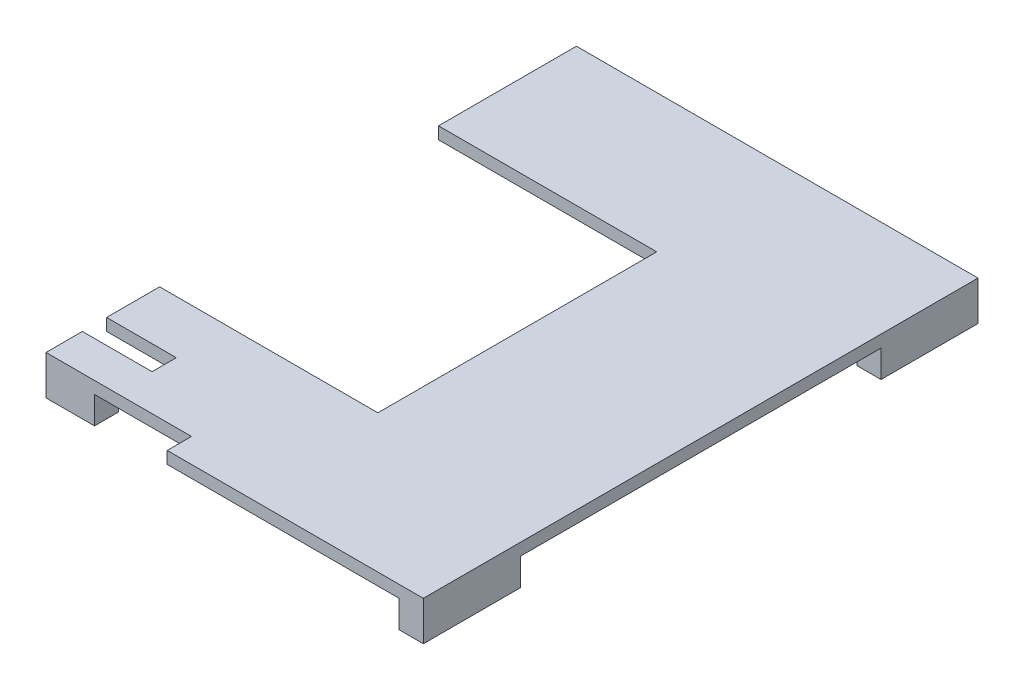
ISO-10303-21;
HEADER;
FILE_DESCRIPTION(('STEP AP214'),'2;1');
FILE_NAME('part.step','',(''),(''),'','','');
FILE_SCHEMA(('AUTOMOTIVE_DESIGN { 1 0 10303 214 1 1 1 1 }'));
ENDSEC;
DATA;
#1=APPLICATION_CONTEXT('core data for automotive mechanical design processes');
#2=APPLICATION_PROTOCOL_DEFINITION('international standard','automotive_design',2000,#1);
#3=PRODUCT_CONTEXT('',#1,'mechanical');
#4=PRODUCT('Part','Part','',(#3));
#5=PRODUCT_RELATED_PRODUCT_CATEGORY('part','',(#4));
#6=PRODUCT_DEFINITION_FORMATION('','',#4);
#7=PRODUCT_DEFINITION_CONTEXT('part definition',#1,'design');
#8=PRODUCT_DEFINITION('design','',#6,#7);
#9=PRODUCT_DEFINITION_SHAPE('','',#8);
#10=(LENGTH_UNIT() NAMED_UNIT(*) SI_UNIT(.MILLI.,.METRE.));
#11=(NAMED_UNIT(*) PLANE_ANGLE_UNIT() SI_UNIT($,.RADIAN.));
#12=(NAMED_UNIT(*) SI_UNIT($,.STERADIAN.) SOLID_ANGLE_UNIT());
#13=UNCERTAINTY_MEASURE_WITH_UNIT(LENGTH_MEASURE(1.E-05),#10,'distance_accuracy_value','');
#14=(GEOMETRIC_REPRESENTATION_CONTEXT(3) GLOBAL_UNCERTAINTY_ASSIGNED_CONTEXT((#13)) GLOBAL_UNIT_ASSIGNED_CONTEXT((#10,
#11,#12)) REPRESENTATION_CONTEXT('',''));
#15=CARTESIAN_POINT('',(0.,0.,0.));
#16=DIRECTION('',(0.,0.,1.));
#17=DIRECTION('',(1.,0.,0.));
#18=AXIS2_PLACEMENT_3D('',#15,#16,#17);
#19=CARTESIAN_POINT('',(0.,0.,0.));
#20=DIRECTION('',(1.,0.,0.));
#21=DIRECTION('',(0.,0.,-1.));
#22=AXIS2_PLACEMENT_3D('',#19,#20,#21);
#23=PLANE('',#22);
#24=DIRECTION('',(0.,0.,1.));
#25=VECTOR('',#24,1.);
#26=CARTESIAN_POINT('',(0.,6.35,0.));
#27=LINE('',#26,#25);
#28=CARTESIAN_POINT('',(0.,6.35,73.025));
#29=VERTEX_POINT('',#28);
#30=CARTESIAN_POINT('',(0.,6.35,100.80625));
#31=VERTEX_POINT('',#30);
#32=EDGE_CURVE('E379',#29,#31,#27,.T.);
#33=ORIENTED_EDGE('',*,*,#32,.F.);
#34=DIRECTION('',(0.,1.,0.));
#35=VECTOR('',#34,1.);
#36=CARTESIAN_POINT('',(0.,0.,73.025));
#37=LINE('',#36,#35);
#38=CARTESIAN_POINT('',(0.,0.,73.025));
#39=VERTEX_POINT('',#38);
#40=EDGE_CURVE('E391',#39,#29,#37,.T.);
#41=ORIENTED_EDGE('',*,*,#40,.F.);
#42=DIRECTION('',(0.,0.,1.));
#43=VECTOR('',#42,1.);
#44=CARTESIAN_POINT('',(0.,0.,0.));
#45=LINE('',#44,#43);
#46=CARTESIAN_POINT('',(0.,0.,100.80625));
#47=VERTEX_POINT('',#46);
#48=EDGE_CURVE('E382',#39,#47,#45,.T.);
#49=ORIENTED_EDGE('',*,*,#48,.T.);
#50=DIRECTION('',(0.,-1.,0.));
#51=VECTOR('',#50,1.);
#52=CARTESIAN_POINT('',(0.,0.,100.80625));
#53=LINE('',#52,#51);
#54=EDGE_CURVE('E36',#31,#47,#53,.T.);
#55=ORIENTED_EDGE('',*,*,#54,.F.);
#56=EDGE_LOOP('',(#33,#41,#49,#55));
#57=FACE_BOUND('',#56,.T.);
#58=ADVANCED_FACE('F33',(#57),#23,.F.);
#59=DIRECTION('',(0.,1.,0.));
#60=VECTOR('',#59,1.);
#61=CARTESIAN_POINT('',(0.,6.35,-145.25625));
#62=LINE('',#61,#60);
#63=CARTESIAN_POINT('',(0.,-14.2875,-145.25625));
#64=VERTEX_POINT('',#63);
#65=CARTESIAN_POINT('',(0.,6.35,-145.25625));
#66=VERTEX_POINT('',#65);
#67=EDGE_CURVE('E378',#64,#66,#62,.T.);
#68=ORIENTED_EDGE('',*,*,#67,.F.);
#69=DIRECTION('',(0.,0.,-1.));
#70=VECTOR('',#69,1.);
#71=CARTESIAN_POINT('',(0.,-14.2875,0.));
#72=LINE('',#71,#70);
#73=CARTESIAN_POINT('',(0.,-14.2875,-132.55625));
#74=VERTEX_POINT('',#73);
#75=EDGE_CURVE('E372',#74,#64,#72,.T.);
#76=ORIENTED_EDGE('',*,*,#75,.F.);
#77=DIRECTION('',(0.,-1.,0.));
#78=VECTOR('',#77,1.);
#79=CARTESIAN_POINT('',(0.,-14.2875,-132.55625));
#80=LINE('',#79,#78);
#81=CARTESIAN_POINT('',(0.,0.,-132.55625));
#82=VERTEX_POINT('',#81);
#83=EDGE_CURVE('E386',#82,#74,#80,.T.);
#84=ORIENTED_EDGE('',*,*,#83,.F.);
#85=CARTESIAN_POINT('',(0.,0.,-73.025));
#86=VERTEX_POINT('',#85);
#87=EDGE_CURVE('E383',#82,#86,#45,.T.);
#88=ORIENTED_EDGE('',*,*,#87,.T.);
#89=DIRECTION('',(0.,-1.,0.));
#90=VECTOR('',#89,1.);
#91=CARTESIAN_POINT('',(0.,0.,-73.025));
#92=LINE('',#91,#90);
#93=CARTESIAN_POINT('',(0.,6.35,-73.025));
#94=VERTEX_POINT('',#93);
#95=EDGE_CURVE('E388',#94,#86,#92,.T.);
#96=ORIENTED_EDGE('',*,*,#95,.F.);
#97=EDGE_CURVE('E376',#66,#94,#27,.T.);
#98=ORIENTED_EDGE('',*,*,#97,.F.);
#99=EDGE_LOOP('',(#68,#76,#84,#88,#96,#98));
#100=FACE_BOUND('',#99,.T.);
#101=ADVANCED_FACE('F450',(#100),#23,.F.);
#102=CARTESIAN_POINT('',(0.,0.,113.50625));
#103=VERTEX_POINT('',#102);
#104=CARTESIAN_POINT('',(0.,0.,119.85625));
#105=VERTEX_POINT('',#104);
#106=EDGE_CURVE('E41',#103,#105,#45,.T.);
#107=ORIENTED_EDGE('',*,*,#106,.T.);
#108=DIRECTION('',(0.,1.,0.));
#109=VECTOR('',#108,1.);
#110=CARTESIAN_POINT('',(0.,-14.2875,119.85625));
#111=LINE('',#110,#109);
#112=CARTESIAN_POINT('',(0.,-14.2875,119.85625));
#113=VERTEX_POINT('',#112);
#114=EDGE_CURVE('E369',#113,#105,#111,.T.);
#115=ORIENTED_EDGE('',*,*,#114,.F.);
#116=DIRECTION('',(0.,0.,1.));
#117=VECTOR('',#116,1.);
#118=CARTESIAN_POINT('',(0.,-14.2875,0.));
#119=LINE('',#118,#117);
#120=CARTESIAN_POINT('',(0.,-14.2875,132.55625));
#121=VERTEX_POINT('',#120);
#122=EDGE_CURVE('E11',#113,#121,#119,.T.);
#123=ORIENTED_EDGE('',*,*,#122,.T.);
#124=DIRECTION('',(0.,-1.,0.));
#125=VECTOR('',#124,1.);
#126=CARTESIAN_POINT('',(0.,0.,132.55625));
#127=LINE('',#126,#125);
#128=CARTESIAN_POINT('',(0.,6.35,132.55625));
#129=VERTEX_POINT('',#128);
#130=EDGE_CURVE('E55',#129,#121,#127,.T.);
#131=ORIENTED_EDGE('',*,*,#130,.F.);
#132=CARTESIAN_POINT('',(0.,6.35,113.50625));
#133=VERTEX_POINT('',#132);
#134=EDGE_CURVE('E374',#133,#129,#27,.T.);
#135=ORIENTED_EDGE('',*,*,#134,.F.);
#136=DIRECTION('',(0.,1.,0.));
#137=VECTOR('',#136,1.);
#138=CARTESIAN_POINT('',(0.,0.,113.50625));
#139=LINE('',#138,#137);
#140=EDGE_CURVE('E375',#103,#133,#139,.T.);
#141=ORIENTED_EDGE('',*,*,#140,.F.);
#142=EDGE_LOOP('',(#107,#115,#123,#131,#135,#141));
#143=FACE_BOUND('',#142,.T.);
#144=ADVANCED_FACE('F421',(#143),#23,.F.);
#145=CARTESIAN_POINT('',(0.,0.,0.));
#146=DIRECTION('',(0.,-1.,0.));
#147=DIRECTION('',(0.,0.,-1.));
#148=AXIS2_PLACEMENT_3D('',#145,#146,#147);
#149=PLANE('',#148);
#150=ORIENTED_EDGE('',*,*,#87,.F.);
#151=DIRECTION('',(-1.,0.,0.));
#152=VECTOR('',#151,1.);
#153=CARTESIAN_POINT('',(25.4,0.,-132.55625));
#154=LINE('',#153,#152);
#155=CARTESIAN_POINT('',(25.4,0.,-132.55625));
#156=VERTEX_POINT('',#155);
#157=EDGE_CURVE('E237',#156,#82,#154,.T.);
#158=ORIENTED_EDGE('',*,*,#157,.F.);
#159=DIRECTION('',(0.,0.,1.));
#160=VECTOR('',#159,1.);
#161=CARTESIAN_POINT('',(25.4,0.,-132.55625));
#162=LINE('',#161,#160);
#163=CARTESIAN_POINT('',(25.4,0.,-145.25625));
#164=VERTEX_POINT('',#163);
#165=EDGE_CURVE('E222',#164,#156,#162,.T.);
#166=ORIENTED_EDGE('',*,*,#165,.F.);
#167=DIRECTION('',(-1.,0.,0.));
#168=VECTOR('',#167,1.);
#169=CARTESIAN_POINT('',(-210.34375,0.,-145.25625));
#170=LINE('',#169,#168);
#171=CARTESIAN_POINT('',(197.64375,0.,-145.25625));
#172=VERTEX_POINT('',#171);
#173=EDGE_CURVE('E362',#172,#164,#170,.T.);
#174=ORIENTED_EDGE('',*,*,#173,.F.);
#175=DIRECTION('',(0.,0.,-1.));
#176=VECTOR('',#175,1.);
#177=CARTESIAN_POINT('',(197.64375,0.,-94.45625));
#178=LINE('',#177,#176);
#179=CARTESIAN_POINT('',(197.64375,0.,-94.45625));
#180=VERTEX_POINT('',#179);
#181=EDGE_CURVE('E255',#180,#172,#178,.T.);
#182=ORIENTED_EDGE('',*,*,#181,.F.);
#183=DIRECTION('',(-1.,0.,0.));
#184=VECTOR('',#183,1.);
#185=CARTESIAN_POINT('',(197.64375,0.,-94.45625));
#186=LINE('',#185,#184);
#187=CARTESIAN_POINT('',(210.34375,0.,-94.45625));
#188=VERTEX_POINT('',#187);
#189=EDGE_CURVE('E250',#188,#180,#186,.T.);
#190=ORIENTED_EDGE('',*,*,#189,.F.);
#191=DIRECTION('',(0.,0.,-1.));
#192=VECTOR('',#191,1.);
#193=CARTESIAN_POINT('',(210.34375,0.,145.25625));
#194=LINE('',#193,#192);
#195=CARTESIAN_POINT('',(210.34375,0.,94.4562500000002));
#196=VERTEX_POINT('',#195);
#197=EDGE_CURVE('E314',#196,#188,#194,.T.);
#198=ORIENTED_EDGE('',*,*,#197,.F.);
#199=DIRECTION('',(1.,0.,0.));
#200=VECTOR('',#199,1.);
#201=CARTESIAN_POINT('',(197.64375,0.,94.4562500000002));
#202=LINE('',#201,#200);
#203=CARTESIAN_POINT('',(197.64375,0.,94.4562500000002));
#204=VERTEX_POINT('',#203);
#205=EDGE_CURVE('E277',#204,#196,#202,.T.);
#206=ORIENTED_EDGE('',*,*,#205,.F.);
#207=DIRECTION('',(0.,0.,-1.));
#208=VECTOR('',#207,1.);
#209=CARTESIAN_POINT('',(197.64375,0.,94.4562500000002));
#210=LINE('',#209,#208);
#211=CARTESIAN_POINT('',(197.64375,0.,145.25625));
#212=VERTEX_POINT('',#211);
#213=EDGE_CURVE('E272',#212,#204,#210,.T.);
#214=ORIENTED_EDGE('',*,*,#213,.F.);
#215=DIRECTION('',(1.,0.,0.));
#216=VECTOR('',#215,1.);
#217=CARTESIAN_POINT('',(-210.34375,0.,145.25625));
#218=LINE('',#217,#216);
#219=CARTESIAN_POINT('',(76.2,0.,145.25625));
#220=VERTEX_POINT('',#219);
#221=EDGE_CURVE('E354',#220,#212,#218,.T.);
#222=ORIENTED_EDGE('',*,*,#221,.F.);
#223=DIRECTION('',(0.,0.,-1.));
#224=VECTOR('',#223,1.);
#225=CARTESIAN_POINT('',(76.2,0.,132.55625));
#226=LINE('',#225,#224);
#227=CARTESIAN_POINT('',(76.2,0.,132.55625));
#228=VERTEX_POINT('',#227);
#229=EDGE_CURVE('E338',#220,#228,#226,.T.);
#230=ORIENTED_EDGE('',*,*,#229,.T.);
#231=DIRECTION('',(-1.,0.,0.));
#232=VECTOR('',#231,1.);
#233=CARTESIAN_POINT('',(-76.2,0.,132.55625));
#234=LINE('',#233,#232);
#235=CARTESIAN_POINT('',(25.3999999999999,0.,132.55625));
#236=VERTEX_POINT('',#235);
#237=EDGE_CURVE('E341',#228,#236,#234,.T.);
#238=ORIENTED_EDGE('',*,*,#237,.T.);
#239=DIRECTION('',(0.,0.,1.));
#240=VECTOR('',#239,1.);
#241=CARTESIAN_POINT('',(25.4,0.,119.85625));
#242=LINE('',#241,#240);
#243=CARTESIAN_POINT('',(25.4,0.,119.85625));
#244=VERTEX_POINT('',#243);
#245=EDGE_CURVE('E212',#244,#236,#242,.T.);
#246=ORIENTED_EDGE('',*,*,#245,.F.);
#247=DIRECTION('',(1.,0.,0.));
#248=VECTOR('',#247,1.);
#249=CARTESIAN_POINT('',(25.4,0.,119.85625));
#250=LINE('',#249,#248);
#251=EDGE_CURVE('E218',#105,#244,#250,.T.);
#252=ORIENTED_EDGE('',*,*,#251,.F.);
#253=ORIENTED_EDGE('',*,*,#106,.F.);
#254=DIRECTION('',(1.,0.,0.));
#255=VECTOR('',#254,1.);
#256=CARTESIAN_POINT('',(-36.5125,0.,113.50625));
#257=LINE('',#256,#255);
#258=CARTESIAN_POINT('',(36.5125,0.,113.50625));
#259=VERTEX_POINT('',#258);
#260=EDGE_CURVE('E324',#103,#259,#257,.T.);
#261=ORIENTED_EDGE('',*,*,#260,.T.);
#262=DIRECTION('',(0.,0.,-1.));
#263=VECTOR('',#262,1.);
#264=CARTESIAN_POINT('',(36.5125,0.,113.50625));
#265=LINE('',#264,#263);
#266=CARTESIAN_POINT('',(36.5125,0.,100.80625));
#267=VERTEX_POINT('',#266);
#268=EDGE_CURVE('E317',#259,#267,#265,.T.);
#269=ORIENTED_EDGE('',*,*,#268,.T.);
#270=DIRECTION('',(-1.,0.,0.));
#271=VECTOR('',#270,1.);
#272=CARTESIAN_POINT('',(-36.5125,0.,100.80625));
#273=LINE('',#272,#271);
#274=EDGE_CURVE('E320',#267,#47,#273,.T.);
#275=ORIENTED_EDGE('',*,*,#274,.T.);
#276=ORIENTED_EDGE('',*,*,#48,.F.);
#277=DIRECTION('',(1.,0.,0.));
#278=VECTOR('',#277,1.);
#279=CARTESIAN_POINT('',(-114.3,0.,73.025));
#280=LINE('',#279,#278);
#281=CARTESIAN_POINT('',(114.3,0.,73.025));
#282=VERTEX_POINT('',#281);
#283=EDGE_CURVE('E301',#39,#282,#280,.T.);
#284=ORIENTED_EDGE('',*,*,#283,.T.);
#285=DIRECTION('',(0.,0.,-1.));
#286=VECTOR('',#285,1.);
#287=CARTESIAN_POINT('',(114.3,0.,73.025));
#288=LINE('',#287,#286);
#289=CARTESIAN_POINT('',(114.3,0.,-73.025));
#290=VERTEX_POINT('',#289);
#291=EDGE_CURVE('E294',#282,#290,#288,.T.);
#292=ORIENTED_EDGE('',*,*,#291,.T.);
#293=DIRECTION('',(-1.,0.,0.));
#294=VECTOR('',#293,1.);
#295=CARTESIAN_POINT('',(-114.3,0.,-73.025));
#296=LINE('',#295,#294);
#297=EDGE_CURVE('E297',#290,#86,#296,.T.);
#298=ORIENTED_EDGE('',*,*,#297,.T.);
#299=EDGE_LOOP('',(#150,#158,#166,#174,#182,#190,#198,#206,#214,#222,#230,#238,#246,#252,#253,
#261,#269,#275,#276,#284,#292,#298));
#300=FACE_BOUND('',#299,.T.);
#301=ADVANCED_FACE('F404',(#300),#149,.T.);
#302=CARTESIAN_POINT('',(-210.34375,6.35,145.25625));
#303=DIRECTION('',(0.,0.,-1.));
#304=DIRECTION('',(-1.,0.,0.));
#305=AXIS2_PLACEMENT_3D('',#302,#303,#304);
#306=PLANE('',#305);
#307=DIRECTION('',(1.,0.,0.));
#308=VECTOR('',#307,1.);
#309=CARTESIAN_POINT('',(-210.34375,6.35,145.25625));
#310=LINE('',#309,#308);
#311=CARTESIAN_POINT('',(76.2,6.35,145.25625));
#312=VERTEX_POINT('',#311);
#313=CARTESIAN_POINT('',(210.34375,6.35,145.25625));
#314=VERTEX_POINT('',#313);
#315=EDGE_CURVE('E357',#312,#314,#310,.T.);
#316=ORIENTED_EDGE('',*,*,#315,.F.);
#317=DIRECTION('',(0.,1.,0.));
#318=VECTOR('',#317,1.);
#319=CARTESIAN_POINT('',(76.2,0.,145.25625));
#320=LINE('',#319,#318);
#321=EDGE_CURVE('E330',#220,#312,#320,.T.);
#322=ORIENTED_EDGE('',*,*,#321,.F.);
#323=ORIENTED_EDGE('',*,*,#221,.T.);
#324=DIRECTION('',(0.,1.,0.));
#325=VECTOR('',#324,1.);
#326=CARTESIAN_POINT('',(197.64375,-14.2875,145.25625));
#327=LINE('',#326,#325);
#328=CARTESIAN_POINT('',(197.64375,-14.2875,145.25625));
#329=VERTEX_POINT('',#328);
#330=EDGE_CURVE('E291',#329,#212,#327,.T.);
#331=ORIENTED_EDGE('',*,*,#330,.F.);
#332=DIRECTION('',(-1.,0.,0.));
#333=VECTOR('',#332,1.);
#334=CARTESIAN_POINT('',(197.64375,-14.2875,145.25625));
#335=LINE('',#334,#333);
#336=CARTESIAN_POINT('',(210.34375,-14.2875,145.25625));
#337=VERTEX_POINT('',#336);
#338=EDGE_CURVE('E276',#337,#329,#335,.T.);
#339=ORIENTED_EDGE('',*,*,#338,.F.);
#340=DIRECTION('',(0.,-1.,0.));
#341=VECTOR('',#340,1.);
#342=CARTESIAN_POINT('',(210.34375,6.35,145.25625));
#343=LINE('',#342,#341);
#344=EDGE_CURVE('E359',#314,#337,#343,.T.);
#345=ORIENTED_EDGE('',*,*,#344,.F.);
#346=EDGE_LOOP('',(#316,#322,#323,#331,#339,#345));
#347=FACE_BOUND('',#346,.T.);
#348=ADVANCED_FACE('F430',(#347),#306,.F.);
#349=CARTESIAN_POINT('',(210.34375,6.35,145.25625));
#350=DIRECTION('',(-1.,0.,0.));
#351=DIRECTION('',(0.,0.,1.));
#352=AXIS2_PLACEMENT_3D('',#349,#350,#351);
#353=PLANE('',#352);
#354=ORIENTED_EDGE('',*,*,#344,.T.);
#355=DIRECTION('',(0.,0.,1.));
#356=VECTOR('',#355,1.);
#357=CARTESIAN_POINT('',(210.34375,-14.2875,94.4562500000002));
#358=LINE('',#357,#356);
#359=CARTESIAN_POINT('',(210.34375,-14.2875,94.4562500000002));
#360=VERTEX_POINT('',#359);
#361=EDGE_CURVE('E273',#360,#337,#358,.T.);
#362=ORIENTED_EDGE('',*,*,#361,.F.);
#363=DIRECTION('',(0.,1.,0.));
#364=VECTOR('',#363,1.);
#365=CARTESIAN_POINT('',(210.34375,-14.2875,94.4562500000002));
#366=LINE('',#365,#364);
#367=EDGE_CURVE('E283',#360,#196,#366,.T.);
#368=ORIENTED_EDGE('',*,*,#367,.T.);
#369=ORIENTED_EDGE('',*,*,#197,.T.);
#370=DIRECTION('',(0.,1.,0.));
#371=VECTOR('',#370,1.);
#372=CARTESIAN_POINT('',(210.34375,-14.2875,-94.45625));
#373=LINE('',#372,#371);
#374=CARTESIAN_POINT('',(210.34375,-14.2875,-94.45625));
#375=VERTEX_POINT('',#374);
#376=EDGE_CURVE('E270',#375,#188,#373,.T.);
#377=ORIENTED_EDGE('',*,*,#376,.F.);
#378=DIRECTION('',(0.,0.,1.));
#379=VECTOR('',#378,1.);
#380=CARTESIAN_POINT('',(210.34375,-14.2875,-94.45625));
#381=LINE('',#380,#379);
#382=CARTESIAN_POINT('',(210.34375,-14.2875,-145.25625));
#383=VERTEX_POINT('',#382);
#384=EDGE_CURVE('E251',#383,#375,#381,.T.);
#385=ORIENTED_EDGE('',*,*,#384,.F.);
#386=DIRECTION('',(0.,-1.,0.));
#387=VECTOR('',#386,1.);
#388=CARTESIAN_POINT('',(210.34375,6.35,-145.25625));
#389=LINE('',#388,#387);
#390=CARTESIAN_POINT('',(210.34375,6.35,-145.25625));
#391=VERTEX_POINT('',#390);
#392=EDGE_CURVE('E368',#391,#383,#389,.T.);
#393=ORIENTED_EDGE('',*,*,#392,.F.);
#394=DIRECTION('',(0.,0.,-1.));
#395=VECTOR('',#394,1.);
#396=CARTESIAN_POINT('',(210.34375,6.35,145.25625));
#397=LINE('',#396,#395);
#398=EDGE_CURVE('E350',#314,#391,#397,.T.);
#399=ORIENTED_EDGE('',*,*,#398,.F.);
#400=EDGE_LOOP('',(#354,#362,#368,#369,#377,#385,#393,#399));
#401=FACE_BOUND('',#400,.T.);
#402=ADVANCED_FACE('F438',(#401),#353,.F.);
#403=CARTESIAN_POINT('',(-210.34375,6.35,-145.25625));
#404=DIRECTION('',(0.,0.,1.));
#405=DIRECTION('',(1.,0.,0.));
#406=AXIS2_PLACEMENT_3D('',#403,#404,#405);
#407=PLANE('',#406);
#408=DIRECTION('',(1.,0.,0.));
#409=VECTOR('',#408,1.);
#410=CARTESIAN_POINT('',(25.4,-14.2875,-145.25625));
#411=LINE('',#410,#409);
#412=CARTESIAN_POINT('',(25.4,-14.2875,-145.25625));
#413=VERTEX_POINT('',#412);
#414=EDGE_CURVE('E234',#64,#413,#411,.T.);
#415=ORIENTED_EDGE('',*,*,#414,.F.);
#416=ORIENTED_EDGE('',*,*,#67,.T.);
#417=DIRECTION('',(-1.,0.,0.));
#418=VECTOR('',#417,1.);
#419=CARTESIAN_POINT('',(-210.34375,6.35,-145.25625));
#420=LINE('',#419,#418);
#421=EDGE_CURVE('E353',#391,#66,#420,.T.);
#422=ORIENTED_EDGE('',*,*,#421,.F.);
#423=ORIENTED_EDGE('',*,*,#392,.T.);
#424=DIRECTION('',(1.,0.,0.));
#425=VECTOR('',#424,1.);
#426=CARTESIAN_POINT('',(197.64375,-14.2875,-145.25625));
#427=LINE('',#426,#425);
#428=CARTESIAN_POINT('',(197.64375,-14.2875,-145.25625));
#429=VERTEX_POINT('',#428);
#430=EDGE_CURVE('E259',#429,#383,#427,.T.);
#431=ORIENTED_EDGE('',*,*,#430,.F.);
#432=DIRECTION('',(0.,1.,0.));
#433=VECTOR('',#432,1.);
#434=CARTESIAN_POINT('',(197.64375,-14.2875,-145.25625));
#435=LINE('',#434,#433);
#436=EDGE_CURVE('E262',#429,#172,#435,.T.);
#437=ORIENTED_EDGE('',*,*,#436,.T.);
#438=ORIENTED_EDGE('',*,*,#173,.T.);
#439=DIRECTION('',(0.,1.,0.));
#440=VECTOR('',#439,1.);
#441=CARTESIAN_POINT('',(25.4,-14.2875,-145.25625));
#442=LINE('',#441,#440);
#443=EDGE_CURVE('E248',#413,#164,#442,.T.);
#444=ORIENTED_EDGE('',*,*,#443,.F.);
#445=EDGE_LOOP('',(#415,#416,#422,#423,#431,#437,#438,#444));
#446=FACE_BOUND('',#445,.T.);
#447=ADVANCED_FACE('F444',(#446),#407,.F.);
#448=CARTESIAN_POINT('',(0.,6.35,0.));
#449=DIRECTION('',(0.,-1.,0.));
#450=DIRECTION('',(0.,0.,-1.));
#451=AXIS2_PLACEMENT_3D('',#448,#449,#450);
#452=PLANE('',#451);
#453=ORIENTED_EDGE('',*,*,#421,.T.);
#454=ORIENTED_EDGE('',*,*,#97,.T.);
#455=DIRECTION('',(-1.,0.,0.));
#456=VECTOR('',#455,1.);
#457=CARTESIAN_POINT('',(-114.3,6.35,-73.025));
#458=LINE('',#457,#456);
#459=CARTESIAN_POINT('',(114.3,6.35,-73.025));
#460=VERTEX_POINT('',#459);
#461=EDGE_CURVE('E306',#460,#94,#458,.T.);
#462=ORIENTED_EDGE('',*,*,#461,.F.);
#463=DIRECTION('',(0.,0.,-1.));
#464=VECTOR('',#463,1.);
#465=CARTESIAN_POINT('',(114.3,6.35,73.025));
#466=LINE('',#465,#464);
#467=CARTESIAN_POINT('',(114.3,6.35,73.025));
#468=VERTEX_POINT('',#467);
#469=EDGE_CURVE('E304',#468,#460,#466,.T.);
#470=ORIENTED_EDGE('',*,*,#469,.F.);
#471=DIRECTION('',(1.,0.,0.));
#472=VECTOR('',#471,1.);
#473=CARTESIAN_POINT('',(-114.3,6.35,73.025));
#474=LINE('',#473,#472);
#475=EDGE_CURVE('E298',#29,#468,#474,.T.);
#476=ORIENTED_EDGE('',*,*,#475,.F.);
#477=ORIENTED_EDGE('',*,*,#32,.T.);
#478=DIRECTION('',(-1.,0.,0.));
#479=VECTOR('',#478,1.);
#480=CARTESIAN_POINT('',(-36.5125,6.35,100.80625));
#481=LINE('',#480,#479);
#482=CARTESIAN_POINT('',(36.5125,6.35,100.80625));
#483=VERTEX_POINT('',#482);
#484=EDGE_CURVE('E329',#483,#31,#481,.T.);
#485=ORIENTED_EDGE('',*,*,#484,.F.);
#486=DIRECTION('',(0.,0.,-1.));
#487=VECTOR('',#486,1.);
#488=CARTESIAN_POINT('',(36.5125,6.35,113.50625));
#489=LINE('',#488,#487);
#490=CARTESIAN_POINT('',(36.5125,6.35,113.50625));
#491=VERTEX_POINT('',#490);
#492=EDGE_CURVE('E327',#491,#483,#489,.T.);
#493=ORIENTED_EDGE('',*,*,#492,.F.);
#494=DIRECTION('',(1.,0.,0.));
#495=VECTOR('',#494,1.);
#496=CARTESIAN_POINT('',(-36.5125,6.35,113.50625));
#497=LINE('',#496,#495);
#498=EDGE_CURVE('E321',#133,#491,#497,.T.);
#499=ORIENTED_EDGE('',*,*,#498,.F.);
#500=ORIENTED_EDGE('',*,*,#134,.T.);
#501=DIRECTION('',(-1.,0.,0.));
#502=VECTOR('',#501,1.);
#503=CARTESIAN_POINT('',(-76.2,6.35,132.55625));
#504=LINE('',#503,#502);
#505=CARTESIAN_POINT('',(76.2,6.35,132.55625));
#506=VERTEX_POINT('',#505);
#507=EDGE_CURVE('E342',#506,#129,#504,.T.);
#508=ORIENTED_EDGE('',*,*,#507,.F.);
#509=DIRECTION('',(0.,0.,-1.));
#510=VECTOR('',#509,1.);
#511=CARTESIAN_POINT('',(76.2,6.35,132.55625));
#512=LINE('',#511,#510);
#513=EDGE_CURVE('E293',#312,#506,#512,.T.);
#514=ORIENTED_EDGE('',*,*,#513,.F.);
#515=ORIENTED_EDGE('',*,*,#315,.T.);
#516=ORIENTED_EDGE('',*,*,#398,.T.);
#517=EDGE_LOOP('',(#453,#454,#462,#470,#476,#477,#485,#493,#499,#500,#508,#514,#515,#516));
#518=FACE_BOUND('',#517,.T.);
#519=ADVANCED_FACE('F413',(#518),#452,.F.);
#520=CARTESIAN_POINT('',(76.2,0.,132.55625));
#521=DIRECTION('',(1.,0.,0.));
#522=DIRECTION('',(0.,0.,-1.));
#523=AXIS2_PLACEMENT_3D('',#520,#521,#522);
#524=PLANE('',#523);
#525=ORIENTED_EDGE('',*,*,#513,.T.);
#526=DIRECTION('',(0.,1.,0.));
#527=VECTOR('',#526,1.);
#528=CARTESIAN_POINT('',(76.2,0.,132.55625));
#529=LINE('',#528,#527);
#530=EDGE_CURVE('E344',#228,#506,#529,.T.);
#531=ORIENTED_EDGE('',*,*,#530,.F.);
#532=ORIENTED_EDGE('',*,*,#229,.F.);
#533=ORIENTED_EDGE('',*,*,#321,.T.);
#534=EDGE_LOOP('',(#525,#531,#532,#533));
#535=FACE_BOUND('',#534,.T.);
#536=ADVANCED_FACE('F425',(#535),#524,.F.);
#537=CARTESIAN_POINT('',(-76.2,0.,132.55625));
#538=DIRECTION('',(0.,0.,-1.));
#539=DIRECTION('',(-1.,0.,0.));
#540=AXIS2_PLACEMENT_3D('',#537,#538,#539);
#541=PLANE('',#540);
#542=ORIENTED_EDGE('',*,*,#507,.T.);
#543=ORIENTED_EDGE('',*,*,#130,.T.);
#544=DIRECTION('',(-1.,0.,0.));
#545=VECTOR('',#544,1.);
#546=CARTESIAN_POINT('',(25.4,-14.2875,132.55625));
#547=LINE('',#546,#545);
#548=CARTESIAN_POINT('',(25.4,-14.2875,132.55625));
#549=VERTEX_POINT('',#548);
#550=EDGE_CURVE('E227',#549,#121,#547,.T.);
#551=ORIENTED_EDGE('',*,*,#550,.F.);
#552=DIRECTION('',(0.,1.,0.));
#553=VECTOR('',#552,1.);
#554=CARTESIAN_POINT('',(25.4,-14.2875,132.55625));
#555=LINE('',#554,#553);
#556=EDGE_CURVE('E223',#549,#236,#555,.T.);
#557=ORIENTED_EDGE('',*,*,#556,.T.);
#558=ORIENTED_EDGE('',*,*,#237,.F.);
#559=ORIENTED_EDGE('',*,*,#530,.T.);
#560=EDGE_LOOP('',(#542,#543,#551,#557,#558,#559));
#561=FACE_BOUND('',#560,.T.);
#562=ADVANCED_FACE('F422',(#561),#541,.F.);
#563=CARTESIAN_POINT('',(36.5125,0.,113.50625));
#564=DIRECTION('',(1.,0.,0.));
#565=DIRECTION('',(0.,0.,-1.));
#566=AXIS2_PLACEMENT_3D('',#563,#564,#565);
#567=PLANE('',#566);
#568=ORIENTED_EDGE('',*,*,#492,.T.);
#569=DIRECTION('',(0.,1.,0.));
#570=VECTOR('',#569,1.);
#571=CARTESIAN_POINT('',(36.5125,0.,100.80625));
#572=LINE('',#571,#570);
#573=EDGE_CURVE('E326',#267,#483,#572,.T.);
#574=ORIENTED_EDGE('',*,*,#573,.F.);
#575=ORIENTED_EDGE('',*,*,#268,.F.);
#576=DIRECTION('',(0.,1.,0.));
#577=VECTOR('',#576,1.);
#578=CARTESIAN_POINT('',(36.5125,0.,113.50625));
#579=LINE('',#578,#577);
#580=EDGE_CURVE('E307',#259,#491,#579,.T.);
#581=ORIENTED_EDGE('',*,*,#580,.T.);
#582=EDGE_LOOP('',(#568,#574,#575,#581));
#583=FACE_BOUND('',#582,.T.);
#584=ADVANCED_FACE('F410',(#583),#567,.F.);
#585=CARTESIAN_POINT('',(-36.5125,0.,113.50625));
#586=DIRECTION('',(0.,0.,1.));
#587=DIRECTION('',(1.,0.,0.));
#588=AXIS2_PLACEMENT_3D('',#585,#586,#587);
#589=PLANE('',#588);
#590=ORIENTED_EDGE('',*,*,#260,.F.);
#591=ORIENTED_EDGE('',*,*,#140,.T.);
#592=ORIENTED_EDGE('',*,*,#498,.T.);
#593=ORIENTED_EDGE('',*,*,#580,.F.);
#594=EDGE_LOOP('',(#590,#591,#592,#593));
#595=FACE_BOUND('',#594,.T.);
#596=ADVANCED_FACE('F604',(#595),#589,.F.);
#597=CARTESIAN_POINT('',(-36.5125,0.,100.80625));
#598=DIRECTION('',(0.,0.,-1.));
#599=DIRECTION('',(-1.,0.,0.));
#600=AXIS2_PLACEMENT_3D('',#597,#598,#599);
#601=PLANE('',#600);
#602=ORIENTED_EDGE('',*,*,#484,.T.);
#603=ORIENTED_EDGE('',*,*,#54,.T.);
#604=ORIENTED_EDGE('',*,*,#274,.F.);
#605=ORIENTED_EDGE('',*,*,#573,.T.);
#606=EDGE_LOOP('',(#602,#603,#604,#605));
#607=FACE_BOUND('',#606,.T.);
#608=ADVANCED_FACE('F399',(#607),#601,.F.);
#609=CARTESIAN_POINT('',(114.3,0.,73.025));
#610=DIRECTION('',(1.,0.,0.));
#611=DIRECTION('',(0.,0.,-1.));
#612=AXIS2_PLACEMENT_3D('',#609,#610,#611);
#613=PLANE('',#612);
#614=ORIENTED_EDGE('',*,*,#469,.T.);
#615=DIRECTION('',(0.,1.,0.));
#616=VECTOR('',#615,1.);
#617=CARTESIAN_POINT('',(114.3,0.,-73.025));
#618=LINE('',#617,#616);
#619=EDGE_CURVE('E303',#290,#460,#618,.T.);
#620=ORIENTED_EDGE('',*,*,#619,.F.);
#621=ORIENTED_EDGE('',*,*,#291,.F.);
#622=DIRECTION('',(0.,1.,0.));
#623=VECTOR('',#622,1.);
#624=CARTESIAN_POINT('',(114.3,0.,73.025));
#625=LINE('',#624,#623);
#626=EDGE_CURVE('E311',#282,#468,#625,.T.);
#627=ORIENTED_EDGE('',*,*,#626,.T.);
#628=EDGE_LOOP('',(#614,#620,#621,#627));
#629=FACE_BOUND('',#628,.T.);
#630=ADVANCED_FACE('F457',(#629),#613,.F.);
#631=CARTESIAN_POINT('',(-114.3,0.,73.025));
#632=DIRECTION('',(0.,0.,1.));
#633=DIRECTION('',(1.,0.,0.));
#634=AXIS2_PLACEMENT_3D('',#631,#632,#633);
#635=PLANE('',#634);
#636=ORIENTED_EDGE('',*,*,#283,.F.);
#637=ORIENTED_EDGE('',*,*,#40,.T.);
#638=ORIENTED_EDGE('',*,*,#475,.T.);
#639=ORIENTED_EDGE('',*,*,#626,.F.);
#640=EDGE_LOOP('',(#636,#637,#638,#639));
#641=FACE_BOUND('',#640,.T.);
#642=ADVANCED_FACE('F460',(#641),#635,.F.);
#643=CARTESIAN_POINT('',(-114.3,0.,-73.025));
#644=DIRECTION('',(0.,0.,-1.));
#645=DIRECTION('',(-1.,0.,0.));
#646=AXIS2_PLACEMENT_3D('',#643,#644,#645);
#647=PLANE('',#646);
#648=ORIENTED_EDGE('',*,*,#461,.T.);
#649=ORIENTED_EDGE('',*,*,#95,.T.);
#650=ORIENTED_EDGE('',*,*,#297,.F.);
#651=ORIENTED_EDGE('',*,*,#619,.T.);
#652=EDGE_LOOP('',(#648,#649,#650,#651));
#653=FACE_BOUND('',#652,.T.);
#654=ADVANCED_FACE('F455',(#653),#647,.F.);
#655=CARTESIAN_POINT('',(197.64375,-14.2875,94.4562500000002));
#656=DIRECTION('',(1.,0.,0.));
#657=DIRECTION('',(0.,0.,-1.));
#658=AXIS2_PLACEMENT_3D('',#655,#656,#657);
#659=PLANE('',#658);
#660=ORIENTED_EDGE('',*,*,#213,.T.);
#661=DIRECTION('',(0.,1.,0.));
#662=VECTOR('',#661,1.);
#663=CARTESIAN_POINT('',(197.64375,-14.2875,94.4562500000002));
#664=LINE('',#663,#662);
#665=CARTESIAN_POINT('',(197.64375,-14.2875,94.4562500000002));
#666=VERTEX_POINT('',#665);
#667=EDGE_CURVE('E289',#666,#204,#664,.T.);
#668=ORIENTED_EDGE('',*,*,#667,.F.);
#669=DIRECTION('',(0.,0.,-1.));
#670=VECTOR('',#669,1.);
#671=CARTESIAN_POINT('',(197.64375,-14.2875,94.4562500000002));
#672=LINE('',#671,#670);
#673=EDGE_CURVE('E279',#329,#666,#672,.T.);
#674=ORIENTED_EDGE('',*,*,#673,.F.);
#675=ORIENTED_EDGE('',*,*,#330,.T.);
#676=EDGE_LOOP('',(#660,#668,#674,#675));
#677=FACE_BOUND('',#676,.T.);
#678=ADVANCED_FACE('F490',(#677),#659,.F.);
#679=CARTESIAN_POINT('',(197.64375,-14.2875,94.4562500000002));
#680=DIRECTION('',(0.,0.,1.));
#681=DIRECTION('',(1.,0.,0.));
#682=AXIS2_PLACEMENT_3D('',#679,#680,#681);
#683=PLANE('',#682);
#684=ORIENTED_EDGE('',*,*,#205,.T.);
#685=ORIENTED_EDGE('',*,*,#367,.F.);
#686=DIRECTION('',(1.,0.,0.));
#687=VECTOR('',#686,1.);
#688=CARTESIAN_POINT('',(197.64375,-14.2875,94.4562500000002));
#689=LINE('',#688,#687);
#690=EDGE_CURVE('E281',#666,#360,#689,.T.);
#691=ORIENTED_EDGE('',*,*,#690,.F.);
#692=ORIENTED_EDGE('',*,*,#667,.T.);
#693=EDGE_LOOP('',(#684,#685,#691,#692));
#694=FACE_BOUND('',#693,.T.);
#695=ADVANCED_FACE('F485',(#694),#683,.F.);
#696=CARTESIAN_POINT('',(0.,-14.2875,0.));
#697=DIRECTION('',(0.,1.,0.));
#698=DIRECTION('',(0.,0.,1.));
#699=AXIS2_PLACEMENT_3D('',#696,#697,#698);
#700=PLANE('',#699);
#701=ORIENTED_EDGE('',*,*,#361,.T.);
#702=ORIENTED_EDGE('',*,*,#338,.T.);
#703=ORIENTED_EDGE('',*,*,#673,.T.);
#704=ORIENTED_EDGE('',*,*,#690,.T.);
#705=EDGE_LOOP('',(#701,#702,#703,#704));
#706=FACE_BOUND('',#705,.T.);
#707=ADVANCED_FACE('F492',(#706),#700,.F.);
#708=CARTESIAN_POINT('',(197.64375,-14.2875,-94.45625));
#709=DIRECTION('',(0.,0.,-1.));
#710=DIRECTION('',(-1.,0.,0.));
#711=AXIS2_PLACEMENT_3D('',#708,#709,#710);
#712=PLANE('',#711);
#713=ORIENTED_EDGE('',*,*,#189,.T.);
#714=DIRECTION('',(0.,1.,0.));
#715=VECTOR('',#714,1.);
#716=CARTESIAN_POINT('',(197.64375,-14.2875,-94.45625));
#717=LINE('',#716,#715);
#718=CARTESIAN_POINT('',(197.64375,-14.2875,-94.45625));
#719=VERTEX_POINT('',#718);
#720=EDGE_CURVE('E267',#719,#180,#717,.T.);
#721=ORIENTED_EDGE('',*,*,#720,.F.);
#722=DIRECTION('',(-1.,0.,0.));
#723=VECTOR('',#722,1.);
#724=CARTESIAN_POINT('',(197.64375,-14.2875,-94.45625));
#725=LINE('',#724,#723);
#726=EDGE_CURVE('E254',#375,#719,#725,.T.);
#727=ORIENTED_EDGE('',*,*,#726,.F.);
#728=ORIENTED_EDGE('',*,*,#376,.T.);
#729=EDGE_LOOP('',(#713,#721,#727,#728));
#730=FACE_BOUND('',#729,.T.);
#731=ADVANCED_FACE('F494',(#730),#712,.F.);
#732=CARTESIAN_POINT('',(197.64375,-14.2875,-94.45625));
#733=DIRECTION('',(1.,0.,0.));
#734=DIRECTION('',(0.,0.,-1.));
#735=AXIS2_PLACEMENT_3D('',#732,#733,#734);
#736=PLANE('',#735);
#737=ORIENTED_EDGE('',*,*,#181,.T.);
#738=ORIENTED_EDGE('',*,*,#436,.F.);
#739=DIRECTION('',(0.,0.,-1.));
#740=VECTOR('',#739,1.);
#741=CARTESIAN_POINT('',(197.64375,-14.2875,-94.45625));
#742=LINE('',#741,#740);
#743=EDGE_CURVE('E257',#719,#429,#742,.T.);
#744=ORIENTED_EDGE('',*,*,#743,.F.);
#745=ORIENTED_EDGE('',*,*,#720,.T.);
#746=EDGE_LOOP('',(#737,#738,#744,#745));
#747=FACE_BOUND('',#746,.T.);
#748=ADVANCED_FACE('F475',(#747),#736,.F.);
#749=CARTESIAN_POINT('',(0.,-14.2875,0.));
#750=DIRECTION('',(0.,-1.,0.));
#751=DIRECTION('',(0.,0.,-1.));
#752=AXIS2_PLACEMENT_3D('',#749,#750,#751);
#753=PLANE('',#752);
#754=ORIENTED_EDGE('',*,*,#384,.T.);
#755=ORIENTED_EDGE('',*,*,#726,.T.);
#756=ORIENTED_EDGE('',*,*,#743,.T.);
#757=ORIENTED_EDGE('',*,*,#430,.T.);
#758=EDGE_LOOP('',(#754,#755,#756,#757));
#759=FACE_BOUND('',#758,.T.);
#760=ADVANCED_FACE('F530',(#759),#753,.T.);
#761=CARTESIAN_POINT('',(25.4,-14.2875,-132.55625));
#762=DIRECTION('',(-1.,0.,0.));
#763=DIRECTION('',(0.,0.,1.));
#764=AXIS2_PLACEMENT_3D('',#761,#762,#763);
#765=PLANE('',#764);
#766=ORIENTED_EDGE('',*,*,#165,.T.);
#767=DIRECTION('',(0.,1.,0.));
#768=VECTOR('',#767,1.);
#769=CARTESIAN_POINT('',(25.4,-14.2875,-132.55625));
#770=LINE('',#769,#768);
#771=CARTESIAN_POINT('',(25.4,-14.2875,-132.55625));
#772=VERTEX_POINT('',#771);
#773=EDGE_CURVE('E242',#772,#156,#770,.T.);
#774=ORIENTED_EDGE('',*,*,#773,.F.);
#775=DIRECTION('',(0.,0.,1.));
#776=VECTOR('',#775,1.);
#777=CARTESIAN_POINT('',(25.4,-14.2875,-132.55625));
#778=LINE('',#777,#776);
#779=EDGE_CURVE('E236',#413,#772,#778,.T.);
#780=ORIENTED_EDGE('',*,*,#779,.F.);
#781=ORIENTED_EDGE('',*,*,#443,.T.);
#782=EDGE_LOOP('',(#766,#774,#780,#781));
#783=FACE_BOUND('',#782,.T.);
#784=ADVANCED_FACE('F469',(#783),#765,.F.);
#785=CARTESIAN_POINT('',(25.4,-14.2875,-132.55625));
#786=DIRECTION('',(0.,0.,-1.));
#787=DIRECTION('',(-1.,0.,0.));
#788=AXIS2_PLACEMENT_3D('',#785,#786,#787);
#789=PLANE('',#788);
#790=ORIENTED_EDGE('',*,*,#157,.T.);
#791=ORIENTED_EDGE('',*,*,#83,.T.);
#792=DIRECTION('',(-1.,0.,0.));
#793=VECTOR('',#792,1.);
#794=CARTESIAN_POINT('',(25.4,-14.2875,-132.55625));
#795=LINE('',#794,#793);
#796=EDGE_CURVE('E239',#772,#74,#795,.T.);
#797=ORIENTED_EDGE('',*,*,#796,.F.);
#798=ORIENTED_EDGE('',*,*,#773,.T.);
#799=EDGE_LOOP('',(#790,#791,#797,#798));
#800=FACE_BOUND('',#799,.T.);
#801=ADVANCED_FACE('F465',(#800),#789,.F.);
#802=CARTESIAN_POINT('',(0.,-14.2875,0.));
#803=DIRECTION('',(0.,1.,0.));
#804=DIRECTION('',(0.,0.,1.));
#805=AXIS2_PLACEMENT_3D('',#802,#803,#804);
#806=PLANE('',#805);
#807=ORIENTED_EDGE('',*,*,#796,.T.);
#808=ORIENTED_EDGE('',*,*,#75,.T.);
#809=ORIENTED_EDGE('',*,*,#414,.T.);
#810=ORIENTED_EDGE('',*,*,#779,.T.);
#811=EDGE_LOOP('',(#807,#808,#809,#810));
#812=FACE_BOUND('',#811,.T.);
#813=ADVANCED_FACE('F522',(#812),#806,.F.);
#814=CARTESIAN_POINT('',(25.4,-14.2875,119.85625));
#815=DIRECTION('',(0.,0.,1.));
#816=DIRECTION('',(1.,0.,0.));
#817=AXIS2_PLACEMENT_3D('',#814,#815,#816);
#818=PLANE('',#817);
#819=DIRECTION('',(1.,0.,0.));
#820=VECTOR('',#819,1.);
#821=CARTESIAN_POINT('',(25.4,-14.2875,119.85625));
#822=LINE('',#821,#820);
#823=CARTESIAN_POINT('',(25.4,-14.2875,119.85625));
#824=VERTEX_POINT('',#823);
#825=EDGE_CURVE('E205',#113,#824,#822,.T.);
#826=ORIENTED_EDGE('',*,*,#825,.F.);
#827=ORIENTED_EDGE('',*,*,#114,.T.);
#828=ORIENTED_EDGE('',*,*,#251,.T.);
#829=DIRECTION('',(0.,1.,0.));
#830=VECTOR('',#829,1.);
#831=CARTESIAN_POINT('',(25.4,-14.2875,119.85625));
#832=LINE('',#831,#830);
#833=EDGE_CURVE('E215',#824,#244,#832,.T.);
#834=ORIENTED_EDGE('',*,*,#833,.F.);
#835=EDGE_LOOP('',(#826,#827,#828,#834));
#836=FACE_BOUND('',#835,.T.);
#837=ADVANCED_FACE('F216',(#836),#818,.F.);
#838=CARTESIAN_POINT('',(25.4,-14.2875,119.85625));
#839=DIRECTION('',(-1.,0.,0.));
#840=DIRECTION('',(0.,0.,1.));
#841=AXIS2_PLACEMENT_3D('',#838,#839,#840);
#842=PLANE('',#841);
#843=ORIENTED_EDGE('',*,*,#245,.T.);
#844=ORIENTED_EDGE('',*,*,#556,.F.);
#845=DIRECTION('',(0.,0.,1.));
#846=VECTOR('',#845,1.);
#847=CARTESIAN_POINT('',(25.4,-14.2875,119.85625));
#848=LINE('',#847,#846);
#849=EDGE_CURVE('E209',#824,#549,#848,.T.);
#850=ORIENTED_EDGE('',*,*,#849,.F.);
#851=ORIENTED_EDGE('',*,*,#833,.T.);
#852=EDGE_LOOP('',(#843,#844,#850,#851));
#853=FACE_BOUND('',#852,.T.);
#854=ADVANCED_FACE('F225',(#853),#842,.F.);
#855=CARTESIAN_POINT('',(0.,-14.2875,0.));
#856=DIRECTION('',(0.,-1.,0.));
#857=DIRECTION('',(0.,0.,-1.));
#858=AXIS2_PLACEMENT_3D('',#855,#856,#857);
#859=PLANE('',#858);
#860=ORIENTED_EDGE('',*,*,#122,.F.);
#861=ORIENTED_EDGE('',*,*,#825,.T.);
#862=ORIENTED_EDGE('',*,*,#849,.T.);
#863=ORIENTED_EDGE('',*,*,#550,.T.);
#864=EDGE_LOOP('',(#860,#861,#862,#863));
#865=FACE_BOUND('',#864,.T.);
#866=ADVANCED_FACE('F207',(#865),#859,.T.);
#867=CLOSED_SHELL('',(#58,#101,#144,#301,#348,#402,#447,#519,#536,#562,#584,#596,#608,#630,#642,
#654,#678,#695,#707,#731,#748,#760,#784,#801,#813,#837,#854,#866));
#868=MANIFOLD_SOLID_BREP('B2',#867);
#869=ADVANCED_BREP_SHAPE_REPRESENTATION('',(#18,#868),#14);
#870=SHAPE_DEFINITION_REPRESENTATION(#9,#869);
ENDSEC;
END-ISO-10303-21;
